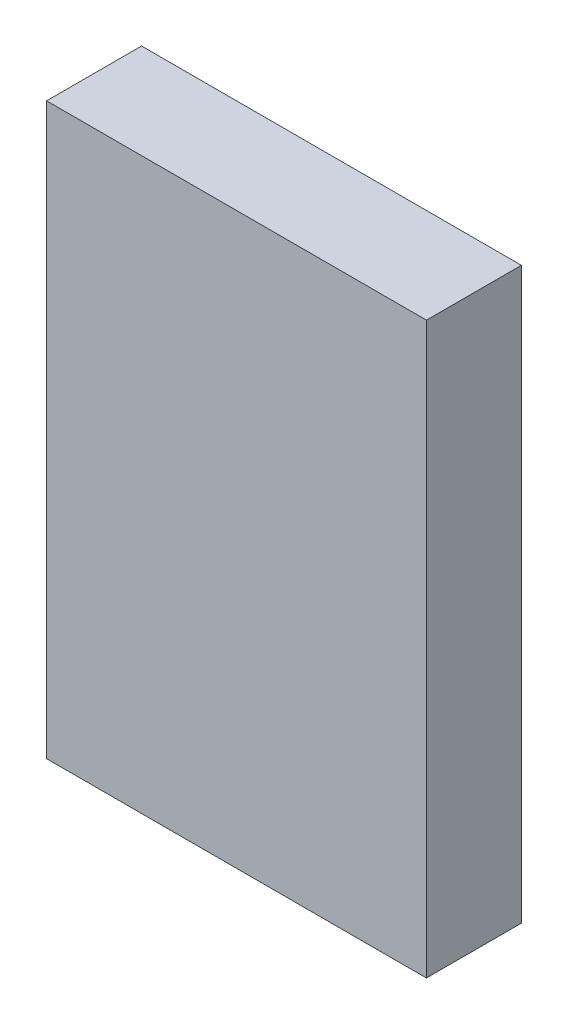
ISO-10303-21;
HEADER;
FILE_DESCRIPTION(('STEP AP214'),'2;1');
FILE_NAME('part.step','',(''),(''),'','','');
FILE_SCHEMA(('AUTOMOTIVE_DESIGN { 1 0 10303 214 1 1 1 1 }'));
ENDSEC;
DATA;
#1=APPLICATION_CONTEXT('core data for automotive mechanical design processes');
#2=APPLICATION_PROTOCOL_DEFINITION('international standard','automotive_design',2000,#1);
#3=PRODUCT_CONTEXT('',#1,'mechanical');
#4=PRODUCT('Part','Part','',(#3));
#5=PRODUCT_RELATED_PRODUCT_CATEGORY('part','',(#4));
#6=PRODUCT_DEFINITION_FORMATION('','',#4);
#7=PRODUCT_DEFINITION_CONTEXT('part definition',#1,'design');
#8=PRODUCT_DEFINITION('design','',#6,#7);
#9=PRODUCT_DEFINITION_SHAPE('','',#8);
#10=(LENGTH_UNIT() NAMED_UNIT(*) SI_UNIT(.MILLI.,.METRE.));
#11=(NAMED_UNIT(*) PLANE_ANGLE_UNIT() SI_UNIT($,.RADIAN.));
#12=(NAMED_UNIT(*) SI_UNIT($,.STERADIAN.) SOLID_ANGLE_UNIT());
#13=UNCERTAINTY_MEASURE_WITH_UNIT(LENGTH_MEASURE(1.E-05),#10,'distance_accuracy_value','');
#14=(GEOMETRIC_REPRESENTATION_CONTEXT(3) GLOBAL_UNCERTAINTY_ASSIGNED_CONTEXT((#13)) GLOBAL_UNIT_ASSIGNED_CONTEXT((#10,
#11,#12)) REPRESENTATION_CONTEXT('',''));
#15=CARTESIAN_POINT('',(0.,0.,0.));
#16=DIRECTION('',(0.,0.,1.));
#17=DIRECTION('',(1.,0.,0.));
#18=AXIS2_PLACEMENT_3D('',#15,#16,#17);
#19=CARTESIAN_POINT('',(0.,0.,5.));
#20=DIRECTION('',(1.,0.,0.));
#21=DIRECTION('',(0.,0.,-1.));
#22=AXIS2_PLACEMENT_3D('',#19,#20,#21);
#23=PLANE('',#22);
#24=DIRECTION('',(0.,-1.,0.));
#25=VECTOR('',#24,1.);
#26=CARTESIAN_POINT('',(0.,0.,0.));
#27=LINE('',#26,#25);
#28=CARTESIAN_POINT('',(0.,30.,0.));
#29=VERTEX_POINT('',#28);
#30=CARTESIAN_POINT('',(0.,0.,0.));
#31=VERTEX_POINT('',#30);
#32=EDGE_CURVE('E98',#29,#31,#27,.T.);
#33=ORIENTED_EDGE('',*,*,#32,.T.);
#34=DIRECTION('',(0.,0.,-1.));
#35=VECTOR('',#34,1.);
#36=CARTESIAN_POINT('',(0.,0.,5.));
#37=LINE('',#36,#35);
#38=CARTESIAN_POINT('',(0.,0.,5.));
#39=VERTEX_POINT('',#38);
#40=EDGE_CURVE('E11',#39,#31,#37,.T.);
#41=ORIENTED_EDGE('',*,*,#40,.F.);
#42=DIRECTION('',(0.,-1.,0.));
#43=VECTOR('',#42,1.);
#44=CARTESIAN_POINT('',(0.,0.,5.));
#45=LINE('',#44,#43);
#46=CARTESIAN_POINT('',(0.,30.,5.));
#47=VERTEX_POINT('',#46);
#48=EDGE_CURVE('E86',#47,#39,#45,.T.);
#49=ORIENTED_EDGE('',*,*,#48,.F.);
#50=DIRECTION('',(0.,0.,-1.));
#51=VECTOR('',#50,1.);
#52=CARTESIAN_POINT('',(0.,30.,5.));
#53=LINE('',#52,#51);
#54=EDGE_CURVE('E94',#47,#29,#53,.T.);
#55=ORIENTED_EDGE('',*,*,#54,.T.);
#56=EDGE_LOOP('',(#33,#41,#49,#55));
#57=FACE_BOUND('',#56,.T.);
#58=ADVANCED_FACE('F35',(#57),#23,.F.);
#59=CARTESIAN_POINT('',(0.,0.,5.));
#60=DIRECTION('',(0.,1.,0.));
#61=DIRECTION('',(0.,0.,1.));
#62=AXIS2_PLACEMENT_3D('',#59,#60,#61);
#63=PLANE('',#62);
#64=DIRECTION('',(1.,0.,0.));
#65=VECTOR('',#64,1.);
#66=CARTESIAN_POINT('',(0.,0.,0.));
#67=LINE('',#66,#65);
#68=CARTESIAN_POINT('',(20.,0.,0.));
#69=VERTEX_POINT('',#68);
#70=EDGE_CURVE('E90',#31,#69,#67,.T.);
#71=ORIENTED_EDGE('',*,*,#70,.T.);
#72=DIRECTION('',(0.,0.,-1.));
#73=VECTOR('',#72,1.);
#74=CARTESIAN_POINT('',(20.,0.,5.));
#75=LINE('',#74,#73);
#76=CARTESIAN_POINT('',(20.,0.,5.));
#77=VERTEX_POINT('',#76);
#78=EDGE_CURVE('E43',#77,#69,#75,.T.);
#79=ORIENTED_EDGE('',*,*,#78,.F.);
#80=DIRECTION('',(1.,0.,0.));
#81=VECTOR('',#80,1.);
#82=CARTESIAN_POINT('',(0.,0.,5.));
#83=LINE('',#82,#81);
#84=EDGE_CURVE('E81',#39,#77,#83,.T.);
#85=ORIENTED_EDGE('',*,*,#84,.F.);
#86=ORIENTED_EDGE('',*,*,#40,.T.);
#87=EDGE_LOOP('',(#71,#79,#85,#86));
#88=FACE_BOUND('',#87,.T.);
#89=ADVANCED_FACE('F89',(#88),#63,.F.);
#90=CARTESIAN_POINT('',(20.,0.,5.));
#91=DIRECTION('',(-1.,0.,0.));
#92=DIRECTION('',(0.,0.,1.));
#93=AXIS2_PLACEMENT_3D('',#90,#91,#92);
#94=PLANE('',#93);
#95=DIRECTION('',(0.,1.,0.));
#96=VECTOR('',#95,1.);
#97=CARTESIAN_POINT('',(20.,0.,0.));
#98=LINE('',#97,#96);
#99=CARTESIAN_POINT('',(20.,30.,0.));
#100=VERTEX_POINT('',#99);
#101=EDGE_CURVE('E68',#69,#100,#98,.T.);
#102=ORIENTED_EDGE('',*,*,#101,.T.);
#103=DIRECTION('',(0.,0.,-1.));
#104=VECTOR('',#103,1.);
#105=CARTESIAN_POINT('',(20.,30.,5.));
#106=LINE('',#105,#104);
#107=CARTESIAN_POINT('',(20.,30.,5.));
#108=VERTEX_POINT('',#107);
#109=EDGE_CURVE('E91',#108,#100,#106,.T.);
#110=ORIENTED_EDGE('',*,*,#109,.F.);
#111=DIRECTION('',(0.,1.,0.));
#112=VECTOR('',#111,1.);
#113=CARTESIAN_POINT('',(20.,0.,5.));
#114=LINE('',#113,#112);
#115=EDGE_CURVE('E84',#77,#108,#114,.T.);
#116=ORIENTED_EDGE('',*,*,#115,.F.);
#117=ORIENTED_EDGE('',*,*,#78,.T.);
#118=EDGE_LOOP('',(#102,#110,#116,#117));
#119=FACE_BOUND('',#118,.T.);
#120=ADVANCED_FACE('F92',(#119),#94,.F.);
#121=CARTESIAN_POINT('',(0.,30.,5.));
#122=DIRECTION('',(0.,-1.,0.));
#123=DIRECTION('',(0.,0.,-1.));
#124=AXIS2_PLACEMENT_3D('',#121,#122,#123);
#125=PLANE('',#124);
#126=DIRECTION('',(-1.,0.,0.));
#127=VECTOR('',#126,1.);
#128=CARTESIAN_POINT('',(0.,30.,0.));
#129=LINE('',#128,#127);
#130=EDGE_CURVE('E74',#100,#29,#129,.T.);
#131=ORIENTED_EDGE('',*,*,#130,.T.);
#132=ORIENTED_EDGE('',*,*,#54,.F.);
#133=DIRECTION('',(-1.,0.,0.));
#134=VECTOR('',#133,1.);
#135=CARTESIAN_POINT('',(0.,30.,5.));
#136=LINE('',#135,#134);
#137=EDGE_CURVE('E51',#108,#47,#136,.T.);
#138=ORIENTED_EDGE('',*,*,#137,.F.);
#139=ORIENTED_EDGE('',*,*,#109,.T.);
#140=EDGE_LOOP('',(#131,#132,#138,#139));
#141=FACE_BOUND('',#140,.T.);
#142=ADVANCED_FACE('F105',(#141),#125,.F.);
#143=CARTESIAN_POINT('',(0.,0.,5.));
#144=DIRECTION('',(0.,0.,-1.));
#145=DIRECTION('',(-1.,0.,0.));
#146=AXIS2_PLACEMENT_3D('',#143,#144,#145);
#147=PLANE('',#146);
#148=ORIENTED_EDGE('',*,*,#48,.T.);
#149=ORIENTED_EDGE('',*,*,#84,.T.);
#150=ORIENTED_EDGE('',*,*,#115,.T.);
#151=ORIENTED_EDGE('',*,*,#137,.T.);
#152=EDGE_LOOP('',(#148,#149,#150,#151));
#153=FACE_BOUND('',#152,.T.);
#154=ADVANCED_FACE('F82',(#153),#147,.F.);
#155=CARTESIAN_POINT('',(0.,0.,0.));
#156=DIRECTION('',(0.,0.,-1.));
#157=DIRECTION('',(-1.,0.,0.));
#158=AXIS2_PLACEMENT_3D('',#155,#156,#157);
#159=PLANE('',#158);
#160=ORIENTED_EDGE('',*,*,#32,.F.);
#161=ORIENTED_EDGE('',*,*,#130,.F.);
#162=ORIENTED_EDGE('',*,*,#101,.F.);
#163=ORIENTED_EDGE('',*,*,#70,.F.);
#164=EDGE_LOOP('',(#160,#161,#162,#163));
#165=FACE_BOUND('',#164,.T.);
#166=ADVANCED_FACE('F108',(#165),#159,.T.);
#167=CLOSED_SHELL('',(#58,#89,#120,#142,#154,#166));
#168=MANIFOLD_SOLID_BREP('B2',#167);
#169=ADVANCED_BREP_SHAPE_REPRESENTATION('',(#18,#168),#14);
#170=SHAPE_DEFINITION_REPRESENTATION(#9,#169);
ENDSEC;
END-ISO-10303-21;
